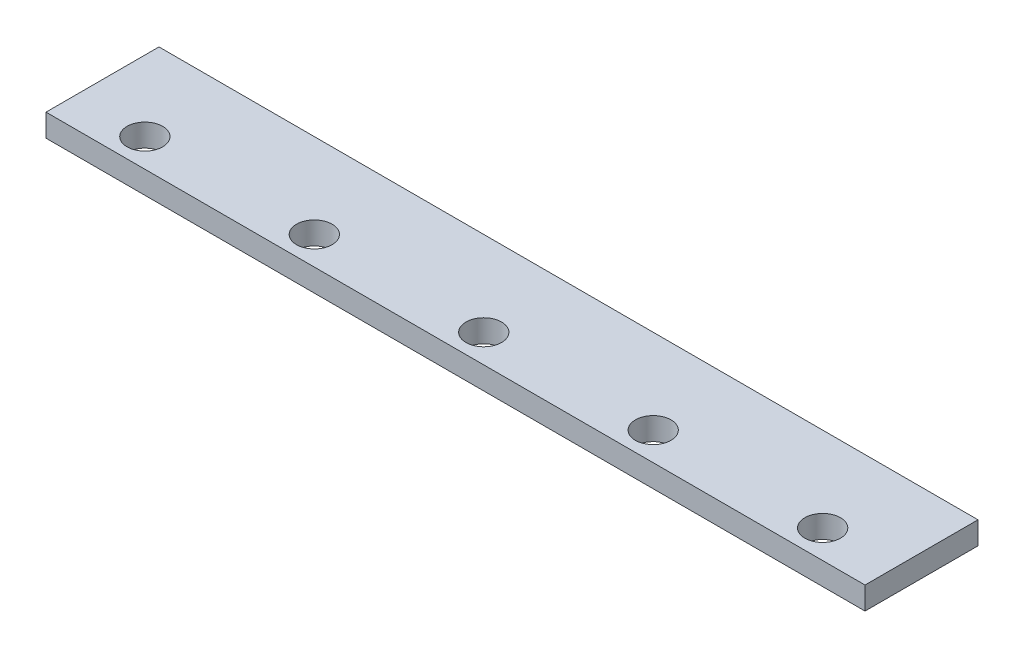
ISO-10303-21;
HEADER;
FILE_DESCRIPTION(('STEP AP214'),'2;1');
FILE_NAME('part.step','',(''),(''),'','','');
FILE_SCHEMA(('AUTOMOTIVE_DESIGN { 1 0 10303 214 1 1 1 1 }'));
ENDSEC;
DATA;
#1=APPLICATION_CONTEXT('core data for automotive mechanical design processes');
#2=APPLICATION_PROTOCOL_DEFINITION('international standard','automotive_design',2000,#1);
#3=PRODUCT_CONTEXT('',#1,'mechanical');
#4=PRODUCT('Part','Part','',(#3));
#5=PRODUCT_RELATED_PRODUCT_CATEGORY('part','',(#4));
#6=PRODUCT_DEFINITION_FORMATION('','',#4);
#7=PRODUCT_DEFINITION_CONTEXT('part definition',#1,'design');
#8=PRODUCT_DEFINITION('design','',#6,#7);
#9=PRODUCT_DEFINITION_SHAPE('','',#8);
#10=(LENGTH_UNIT() NAMED_UNIT(*) SI_UNIT(.MILLI.,.METRE.));
#11=(NAMED_UNIT(*) PLANE_ANGLE_UNIT() SI_UNIT($,.RADIAN.));
#12=(NAMED_UNIT(*) SI_UNIT($,.STERADIAN.) SOLID_ANGLE_UNIT());
#13=UNCERTAINTY_MEASURE_WITH_UNIT(LENGTH_MEASURE(1.E-05),#10,'distance_accuracy_value','');
#14=(GEOMETRIC_REPRESENTATION_CONTEXT(3) GLOBAL_UNCERTAINTY_ASSIGNED_CONTEXT((#13)) GLOBAL_UNIT_ASSIGNED_CONTEXT((#10,
#11,#12)) REPRESENTATION_CONTEXT('',''));
#15=CARTESIAN_POINT('',(0.,0.,0.));
#16=DIRECTION('',(0.,0.,1.));
#17=DIRECTION('',(1.,0.,0.));
#18=AXIS2_PLACEMENT_3D('',#15,#16,#17);
#19=CARTESIAN_POINT('',(0.,16.,0.));
#20=DIRECTION('',(0.,-1.,0.));
#21=DIRECTION('',(0.,0.,-1.));
#22=AXIS2_PLACEMENT_3D('',#19,#20,#21);
#23=PLANE('',#22);
#24=CARTESIAN_POINT('',(50.,16.,-20.));
#25=DIRECTION('',(0.,1.,0.));
#26=DIRECTION('',(0.,0.,-1.));
#27=AXIS2_PLACEMENT_3D('',#24,#25,#26);
#28=CIRCLE('',#27,12.5999999999999);
#29=CARTESIAN_POINT('',(50.,16.,-32.5999999999999));
#30=VERTEX_POINT('',#29);
#31=EDGE_CURVE('E127',#30,#30,#28,.T.);
#32=ORIENTED_EDGE('',*,*,#31,.F.);
#33=EDGE_LOOP('',(#32));
#34=FACE_BOUND('',#33,.T.);
#35=CARTESIAN_POINT('',(410.,16.,-20.));
#36=DIRECTION('',(0.,1.,0.));
#37=DIRECTION('',(0.,0.,1.));
#38=AXIS2_PLACEMENT_3D('',#35,#36,#37);
#39=CIRCLE('',#38,12.6);
#40=CARTESIAN_POINT('',(410.,16.,-7.4));
#41=VERTEX_POINT('',#40);
#42=EDGE_CURVE('E115',#41,#41,#39,.T.);
#43=ORIENTED_EDGE('',*,*,#42,.F.);
#44=EDGE_LOOP('',(#43));
#45=FACE_BOUND('',#44,.T.);
#46=DIRECTION('',(0.,0.,1.));
#47=VECTOR('',#46,1.);
#48=CARTESIAN_POINT('',(0.,16.,0.));
#49=LINE('',#48,#47);
#50=CARTESIAN_POINT('',(0.,16.,-80.));
#51=VERTEX_POINT('',#50);
#52=CARTESIAN_POINT('',(0.,16.,0.));
#53=VERTEX_POINT('',#52);
#54=EDGE_CURVE('E85',#51,#53,#49,.T.);
#55=ORIENTED_EDGE('',*,*,#54,.T.);
#56=DIRECTION('',(1.,0.,0.));
#57=VECTOR('',#56,1.);
#58=CARTESIAN_POINT('',(0.,16.,0.));
#59=LINE('',#58,#57);
#60=CARTESIAN_POINT('',(580.,16.,0.));
#61=VERTEX_POINT('',#60);
#62=EDGE_CURVE('E80',#53,#61,#59,.T.);
#63=ORIENTED_EDGE('',*,*,#62,.T.);
#64=DIRECTION('',(0.,0.,-1.));
#65=VECTOR('',#64,1.);
#66=CARTESIAN_POINT('',(580.,16.,0.));
#67=LINE('',#66,#65);
#68=CARTESIAN_POINT('',(580.,16.,-80.));
#69=VERTEX_POINT('',#68);
#70=EDGE_CURVE('E83',#61,#69,#67,.T.);
#71=ORIENTED_EDGE('',*,*,#70,.T.);
#72=DIRECTION('',(-1.,0.,0.));
#73=VECTOR('',#72,1.);
#74=CARTESIAN_POINT('',(0.,16.,-80.));
#75=LINE('',#74,#73);
#76=EDGE_CURVE('E50',#69,#51,#75,.T.);
#77=ORIENTED_EDGE('',*,*,#76,.T.);
#78=EDGE_LOOP('',(#55,#63,#71,#77));
#79=FACE_BOUND('',#78,.T.);
#80=CARTESIAN_POINT('',(530.,16.,-20.));
#81=DIRECTION('',(0.,1.,0.));
#82=DIRECTION('',(0.,0.,1.));
#83=AXIS2_PLACEMENT_3D('',#80,#81,#82);
#84=CIRCLE('',#83,12.5999999999999);
#85=CARTESIAN_POINT('',(530.,16.,-7.40000000000006));
#86=VERTEX_POINT('',#85);
#87=EDGE_CURVE('E100',#86,#86,#84,.T.);
#88=ORIENTED_EDGE('',*,*,#87,.F.);
#89=EDGE_LOOP('',(#88));
#90=FACE_BOUND('',#89,.T.);
#91=CARTESIAN_POINT('',(290.,16.,-20.));
#92=DIRECTION('',(0.,1.,0.));
#93=DIRECTION('',(0.,0.,1.));
#94=AXIS2_PLACEMENT_3D('',#91,#92,#93);
#95=CIRCLE('',#94,12.6);
#96=CARTESIAN_POINT('',(290.,16.,-7.40000000000001));
#97=VERTEX_POINT('',#96);
#98=EDGE_CURVE('E121',#97,#97,#95,.T.);
#99=ORIENTED_EDGE('',*,*,#98,.F.);
#100=EDGE_LOOP('',(#99));
#101=FACE_BOUND('',#100,.T.);
#102=CARTESIAN_POINT('',(170.,16.,-20.));
#103=DIRECTION('',(0.,1.,0.));
#104=DIRECTION('',(0.,0.,-1.));
#105=AXIS2_PLACEMENT_3D('',#102,#103,#104);
#106=CIRCLE('',#105,12.6);
#107=CARTESIAN_POINT('',(170.,16.,-32.6));
#108=VERTEX_POINT('',#107);
#109=EDGE_CURVE('E133',#108,#108,#106,.T.);
#110=ORIENTED_EDGE('',*,*,#109,.F.);
#111=EDGE_LOOP('',(#110));
#112=FACE_BOUND('',#111,.T.);
#113=ADVANCED_FACE('F33',(#34,#45,#79,#90,#101,#112),#23,.F.);
#114=CARTESIAN_POINT('',(0.,0.,0.));
#115=DIRECTION('',(0.,-1.,0.));
#116=DIRECTION('',(0.,0.,-1.));
#117=AXIS2_PLACEMENT_3D('',#114,#115,#116);
#118=PLANE('',#117);
#119=CARTESIAN_POINT('',(50.,0.,-20.));
#120=DIRECTION('',(0.,1.,0.));
#121=DIRECTION('',(0.,0.,-1.));
#122=AXIS2_PLACEMENT_3D('',#119,#120,#121);
#123=CIRCLE('',#122,12.5999999999999);
#124=CARTESIAN_POINT('',(50.,0.,-32.5999999999999));
#125=VERTEX_POINT('',#124);
#126=EDGE_CURVE('E130',#125,#125,#123,.T.);
#127=ORIENTED_EDGE('',*,*,#126,.T.);
#128=EDGE_LOOP('',(#127));
#129=FACE_BOUND('',#128,.T.);
#130=CARTESIAN_POINT('',(410.,0.,-20.));
#131=DIRECTION('',(0.,1.,0.));
#132=DIRECTION('',(0.,0.,1.));
#133=AXIS2_PLACEMENT_3D('',#130,#131,#132);
#134=CIRCLE('',#133,12.6);
#135=CARTESIAN_POINT('',(410.,0.,-7.4));
#136=VERTEX_POINT('',#135);
#137=EDGE_CURVE('E118',#136,#136,#134,.T.);
#138=ORIENTED_EDGE('',*,*,#137,.T.);
#139=EDGE_LOOP('',(#138));
#140=FACE_BOUND('',#139,.T.);
#141=DIRECTION('',(0.,0.,1.));
#142=VECTOR('',#141,1.);
#143=CARTESIAN_POINT('',(0.,0.,0.));
#144=LINE('',#143,#142);
#145=CARTESIAN_POINT('',(0.,0.,-80.));
#146=VERTEX_POINT('',#145);
#147=CARTESIAN_POINT('',(0.,0.,0.));
#148=VERTEX_POINT('',#147);
#149=EDGE_CURVE('E97',#146,#148,#144,.T.);
#150=ORIENTED_EDGE('',*,*,#149,.F.);
#151=DIRECTION('',(-1.,0.,0.));
#152=VECTOR('',#151,1.);
#153=CARTESIAN_POINT('',(0.,0.,-80.));
#154=LINE('',#153,#152);
#155=CARTESIAN_POINT('',(580.,0.,-80.));
#156=VERTEX_POINT('',#155);
#157=EDGE_CURVE('E73',#156,#146,#154,.T.);
#158=ORIENTED_EDGE('',*,*,#157,.F.);
#159=DIRECTION('',(0.,0.,-1.));
#160=VECTOR('',#159,1.);
#161=CARTESIAN_POINT('',(580.,0.,0.));
#162=LINE('',#161,#160);
#163=CARTESIAN_POINT('',(580.,0.,0.));
#164=VERTEX_POINT('',#163);
#165=EDGE_CURVE('E67',#164,#156,#162,.T.);
#166=ORIENTED_EDGE('',*,*,#165,.F.);
#167=DIRECTION('',(1.,0.,0.));
#168=VECTOR('',#167,1.);
#169=CARTESIAN_POINT('',(0.,0.,0.));
#170=LINE('',#169,#168);
#171=EDGE_CURVE('E89',#148,#164,#170,.T.);
#172=ORIENTED_EDGE('',*,*,#171,.F.);
#173=EDGE_LOOP('',(#150,#158,#166,#172));
#174=FACE_BOUND('',#173,.T.);
#175=CARTESIAN_POINT('',(530.,0.,-20.));
#176=DIRECTION('',(0.,1.,0.));
#177=DIRECTION('',(0.,0.,1.));
#178=AXIS2_PLACEMENT_3D('',#175,#176,#177);
#179=CIRCLE('',#178,12.5999999999999);
#180=CARTESIAN_POINT('',(530.,0.,-7.40000000000006));
#181=VERTEX_POINT('',#180);
#182=EDGE_CURVE('E112',#181,#181,#179,.T.);
#183=ORIENTED_EDGE('',*,*,#182,.T.);
#184=EDGE_LOOP('',(#183));
#185=FACE_BOUND('',#184,.T.);
#186=CARTESIAN_POINT('',(290.,0.,-20.));
#187=DIRECTION('',(0.,1.,0.));
#188=DIRECTION('',(0.,0.,1.));
#189=AXIS2_PLACEMENT_3D('',#186,#187,#188);
#190=CIRCLE('',#189,12.6);
#191=CARTESIAN_POINT('',(290.,0.,-7.40000000000001));
#192=VERTEX_POINT('',#191);
#193=EDGE_CURVE('E124',#192,#192,#190,.T.);
#194=ORIENTED_EDGE('',*,*,#193,.T.);
#195=EDGE_LOOP('',(#194));
#196=FACE_BOUND('',#195,.T.);
#197=CARTESIAN_POINT('',(170.,0.,-20.));
#198=DIRECTION('',(0.,1.,0.));
#199=DIRECTION('',(0.,0.,-1.));
#200=AXIS2_PLACEMENT_3D('',#197,#198,#199);
#201=CIRCLE('',#200,12.6);
#202=CARTESIAN_POINT('',(170.,0.,-32.6));
#203=VERTEX_POINT('',#202);
#204=EDGE_CURVE('E136',#203,#203,#201,.T.);
#205=ORIENTED_EDGE('',*,*,#204,.T.);
#206=EDGE_LOOP('',(#205));
#207=FACE_BOUND('',#206,.T.);
#208=ADVANCED_FACE('F108',(#129,#140,#174,#185,#196,#207),#118,.T.);
#209=CARTESIAN_POINT('',(0.,16.,0.));
#210=DIRECTION('',(1.,0.,0.));
#211=DIRECTION('',(0.,0.,-1.));
#212=AXIS2_PLACEMENT_3D('',#209,#210,#211);
#213=PLANE('',#212);
#214=ORIENTED_EDGE('',*,*,#149,.T.);
#215=DIRECTION('',(0.,-1.,0.));
#216=VECTOR('',#215,1.);
#217=CARTESIAN_POINT('',(0.,16.,0.));
#218=LINE('',#217,#216);
#219=EDGE_CURVE('E11',#53,#148,#218,.T.);
#220=ORIENTED_EDGE('',*,*,#219,.F.);
#221=ORIENTED_EDGE('',*,*,#54,.F.);
#222=DIRECTION('',(0.,-1.,0.));
#223=VECTOR('',#222,1.);
#224=CARTESIAN_POINT('',(0.,16.,-80.));
#225=LINE('',#224,#223);
#226=EDGE_CURVE('E93',#51,#146,#225,.T.);
#227=ORIENTED_EDGE('',*,*,#226,.T.);
#228=EDGE_LOOP('',(#214,#220,#221,#227));
#229=FACE_BOUND('',#228,.T.);
#230=ADVANCED_FACE('F35',(#229),#213,.F.);
#231=CARTESIAN_POINT('',(0.,16.,0.));
#232=DIRECTION('',(0.,0.,-1.));
#233=DIRECTION('',(-1.,0.,0.));
#234=AXIS2_PLACEMENT_3D('',#231,#232,#233);
#235=PLANE('',#234);
#236=ORIENTED_EDGE('',*,*,#171,.T.);
#237=DIRECTION('',(0.,-1.,0.));
#238=VECTOR('',#237,1.);
#239=CARTESIAN_POINT('',(580.,16.,0.));
#240=LINE('',#239,#238);
#241=EDGE_CURVE('E42',#61,#164,#240,.T.);
#242=ORIENTED_EDGE('',*,*,#241,.F.);
#243=ORIENTED_EDGE('',*,*,#62,.F.);
#244=ORIENTED_EDGE('',*,*,#219,.T.);
#245=EDGE_LOOP('',(#236,#242,#243,#244));
#246=FACE_BOUND('',#245,.T.);
#247=ADVANCED_FACE('F88',(#246),#235,.F.);
#248=CARTESIAN_POINT('',(580.,16.,0.));
#249=DIRECTION('',(-1.,0.,0.));
#250=DIRECTION('',(0.,0.,1.));
#251=AXIS2_PLACEMENT_3D('',#248,#249,#250);
#252=PLANE('',#251);
#253=ORIENTED_EDGE('',*,*,#165,.T.);
#254=DIRECTION('',(0.,-1.,0.));
#255=VECTOR('',#254,1.);
#256=CARTESIAN_POINT('',(580.,16.,-80.));
#257=LINE('',#256,#255);
#258=EDGE_CURVE('E90',#69,#156,#257,.T.);
#259=ORIENTED_EDGE('',*,*,#258,.F.);
#260=ORIENTED_EDGE('',*,*,#70,.F.);
#261=ORIENTED_EDGE('',*,*,#241,.T.);
#262=EDGE_LOOP('',(#253,#259,#260,#261));
#263=FACE_BOUND('',#262,.T.);
#264=ADVANCED_FACE('F91',(#263),#252,.F.);
#265=CARTESIAN_POINT('',(0.,16.,-80.));
#266=DIRECTION('',(0.,0.,1.));
#267=DIRECTION('',(1.,0.,0.));
#268=AXIS2_PLACEMENT_3D('',#265,#266,#267);
#269=PLANE('',#268);
#270=ORIENTED_EDGE('',*,*,#157,.T.);
#271=ORIENTED_EDGE('',*,*,#226,.F.);
#272=ORIENTED_EDGE('',*,*,#76,.F.);
#273=ORIENTED_EDGE('',*,*,#258,.T.);
#274=EDGE_LOOP('',(#270,#271,#272,#273));
#275=FACE_BOUND('',#274,.T.);
#276=ADVANCED_FACE('F105',(#275),#269,.F.);
#277=CARTESIAN_POINT('',(530.,16.,-20.));
#278=DIRECTION('',(0.,-1.,0.));
#279=DIRECTION('',(0.,0.,-1.));
#280=AXIS2_PLACEMENT_3D('',#277,#278,#279);
#281=CYLINDRICAL_SURFACE('',#280,12.5999999999999);
#282=ORIENTED_EDGE('',*,*,#87,.T.);
#283=EDGE_LOOP('',(#282));
#284=FACE_BOUND('',#283,.T.);
#285=ORIENTED_EDGE('',*,*,#182,.F.);
#286=EDGE_LOOP('',(#285));
#287=FACE_BOUND('',#286,.T.);
#288=ADVANCED_FACE('F156',(#284,#287),#281,.F.);
#289=CARTESIAN_POINT('',(410.,16.,-20.));
#290=DIRECTION('',(0.,-1.,0.));
#291=DIRECTION('',(0.,0.,-1.));
#292=AXIS2_PLACEMENT_3D('',#289,#290,#291);
#293=CYLINDRICAL_SURFACE('',#292,12.6);
#294=ORIENTED_EDGE('',*,*,#42,.T.);
#295=EDGE_LOOP('',(#294));
#296=FACE_BOUND('',#295,.T.);
#297=ORIENTED_EDGE('',*,*,#137,.F.);
#298=EDGE_LOOP('',(#297));
#299=FACE_BOUND('',#298,.T.);
#300=ADVANCED_FACE('F202',(#296,#299),#293,.F.);
#301=CARTESIAN_POINT('',(290.,16.,-20.));
#302=DIRECTION('',(0.,-1.,0.));
#303=DIRECTION('',(0.,0.,-1.));
#304=AXIS2_PLACEMENT_3D('',#301,#302,#303);
#305=CYLINDRICAL_SURFACE('',#304,12.6);
#306=ORIENTED_EDGE('',*,*,#98,.T.);
#307=EDGE_LOOP('',(#306));
#308=FACE_BOUND('',#307,.T.);
#309=ORIENTED_EDGE('',*,*,#193,.F.);
#310=EDGE_LOOP('',(#309));
#311=FACE_BOUND('',#310,.T.);
#312=ADVANCED_FACE('F210',(#308,#311),#305,.F.);
#313=CARTESIAN_POINT('',(50.,16.,-20.));
#314=DIRECTION('',(0.,-1.,0.));
#315=DIRECTION('',(0.,0.,-1.));
#316=AXIS2_PLACEMENT_3D('',#313,#314,#315);
#317=CYLINDRICAL_SURFACE('',#316,12.5999999999999);
#318=ORIENTED_EDGE('',*,*,#31,.T.);
#319=EDGE_LOOP('',(#318));
#320=FACE_BOUND('',#319,.T.);
#321=ORIENTED_EDGE('',*,*,#126,.F.);
#322=EDGE_LOOP('',(#321));
#323=FACE_BOUND('',#322,.T.);
#324=ADVANCED_FACE('F218',(#320,#323),#317,.F.);
#325=CARTESIAN_POINT('',(170.,16.,-20.));
#326=DIRECTION('',(0.,-1.,0.));
#327=DIRECTION('',(0.,0.,-1.));
#328=AXIS2_PLACEMENT_3D('',#325,#326,#327);
#329=CYLINDRICAL_SURFACE('',#328,12.6);
#330=ORIENTED_EDGE('',*,*,#109,.T.);
#331=EDGE_LOOP('',(#330));
#332=FACE_BOUND('',#331,.T.);
#333=ORIENTED_EDGE('',*,*,#204,.F.);
#334=EDGE_LOOP('',(#333));
#335=FACE_BOUND('',#334,.T.);
#336=ADVANCED_FACE('F142',(#332,#335),#329,.F.);
#337=CLOSED_SHELL('',(#113,#208,#230,#247,#264,#276,#288,#300,#312,#324,#336));
#338=MANIFOLD_SOLID_BREP('B2',#337);
#339=ADVANCED_BREP_SHAPE_REPRESENTATION('',(#18,#338),#14);
#340=SHAPE_DEFINITION_REPRESENTATION(#9,#339);
ENDSEC;
END-ISO-10303-21;
